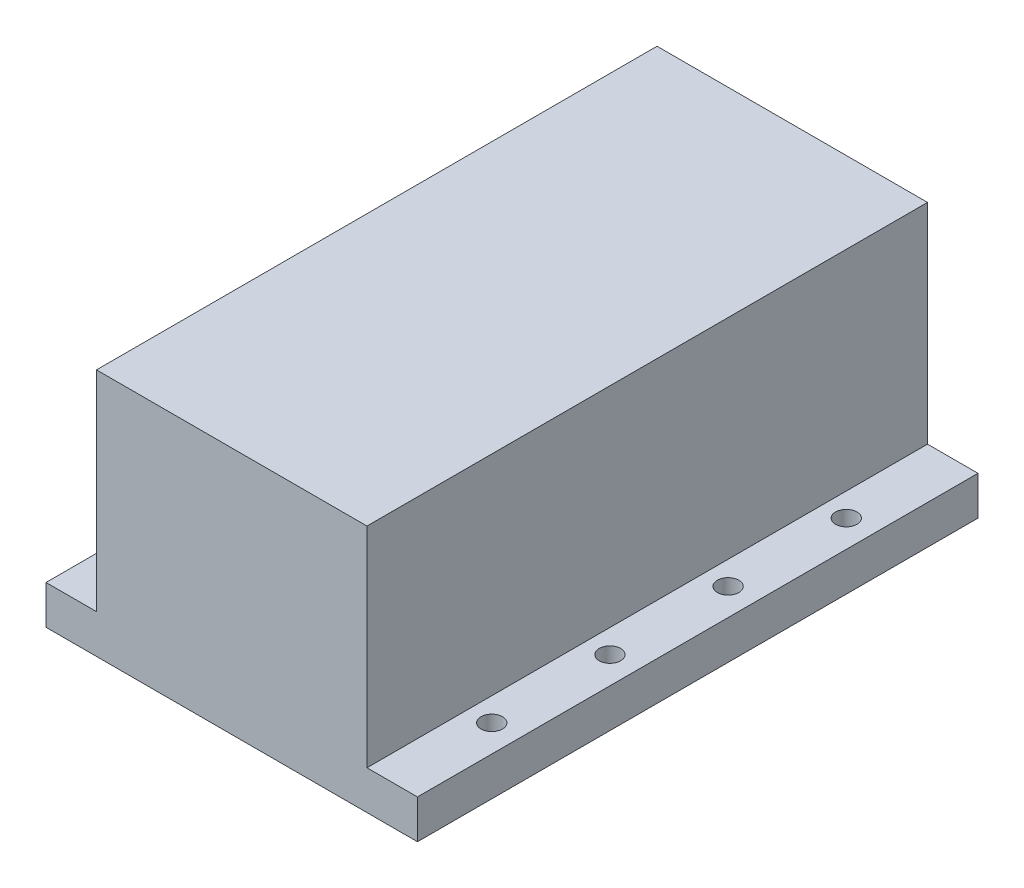
ISO-10303-21;
HEADER;
FILE_DESCRIPTION(('STEP AP214'),'2;1');
FILE_NAME('part.step','',(''),(''),'','','');
FILE_SCHEMA(('AUTOMOTIVE_DESIGN { 1 0 10303 214 1 1 1 1 }'));
ENDSEC;
DATA;
#1=APPLICATION_CONTEXT('core data for automotive mechanical design processes');
#2=APPLICATION_PROTOCOL_DEFINITION('international standard','automotive_design',2000,#1);
#3=PRODUCT_CONTEXT('',#1,'mechanical');
#4=PRODUCT('Part','Part','',(#3));
#5=PRODUCT_RELATED_PRODUCT_CATEGORY('part','',(#4));
#6=PRODUCT_DEFINITION_FORMATION('','',#4);
#7=PRODUCT_DEFINITION_CONTEXT('part definition',#1,'design');
#8=PRODUCT_DEFINITION('design','',#6,#7);
#9=PRODUCT_DEFINITION_SHAPE('','',#8);
#10=(LENGTH_UNIT() NAMED_UNIT(*) SI_UNIT(.MILLI.,.METRE.));
#11=(NAMED_UNIT(*) PLANE_ANGLE_UNIT() SI_UNIT($,.RADIAN.));
#12=(NAMED_UNIT(*) SI_UNIT($,.STERADIAN.) SOLID_ANGLE_UNIT());
#13=UNCERTAINTY_MEASURE_WITH_UNIT(LENGTH_MEASURE(1.E-05),#10,'distance_accuracy_value','');
#14=(GEOMETRIC_REPRESENTATION_CONTEXT(3) GLOBAL_UNCERTAINTY_ASSIGNED_CONTEXT((#13)) GLOBAL_UNIT_ASSIGNED_CONTEXT((#10,
#11,#12)) REPRESENTATION_CONTEXT('',''));
#15=CARTESIAN_POINT('',(0.,0.,0.));
#16=DIRECTION('',(0.,0.,1.));
#17=DIRECTION('',(1.,0.,0.));
#18=AXIS2_PLACEMENT_3D('',#15,#16,#17);
#19=CARTESIAN_POINT('',(0.,11.5,0.));
#20=DIRECTION('',(0.,-1.,0.));
#21=DIRECTION('',(0.,0.,-1.));
#22=AXIS2_PLACEMENT_3D('',#19,#20,#21);
#23=PLANE('',#22);
#24=CARTESIAN_POINT('',(8.,11.5,-30.));
#25=DIRECTION('',(0.,1.,0.));
#26=DIRECTION('',(0.,0.,1.));
#27=AXIS2_PLACEMENT_3D('',#24,#25,#26);
#28=CIRCLE('',#27,3.175);
#29=CARTESIAN_POINT('',(8.,11.5,-26.825));
#30=VERTEX_POINT('',#29);
#31=EDGE_CURVE('E129',#30,#30,#28,.T.);
#32=ORIENTED_EDGE('',*,*,#31,.F.);
#33=EDGE_LOOP('',(#32));
#34=FACE_BOUND('',#33,.T.);
#35=CARTESIAN_POINT('',(7.99999999999999,11.5,-65.));
#36=DIRECTION('',(0.,1.,0.));
#37=DIRECTION('',(0.,0.,1.));
#38=AXIS2_PLACEMENT_3D('',#35,#36,#37);
#39=CIRCLE('',#38,3.175);
#40=CARTESIAN_POINT('',(7.99999999999999,11.5,-61.825));
#41=VERTEX_POINT('',#40);
#42=EDGE_CURVE('E138',#41,#41,#39,.T.);
#43=ORIENTED_EDGE('',*,*,#42,.F.);
#44=EDGE_LOOP('',(#43));
#45=FACE_BOUND('',#44,.T.);
#46=CARTESIAN_POINT('',(7.99999999999999,11.5,-100.));
#47=DIRECTION('',(0.,1.,0.));
#48=DIRECTION('',(0.,0.,1.));
#49=AXIS2_PLACEMENT_3D('',#46,#47,#48);
#50=CIRCLE('',#49,3.175);
#51=CARTESIAN_POINT('',(7.99999999999999,11.5,-96.825));
#52=VERTEX_POINT('',#51);
#53=EDGE_CURVE('E144',#52,#52,#50,.T.);
#54=ORIENTED_EDGE('',*,*,#53,.F.);
#55=EDGE_LOOP('',(#54));
#56=FACE_BOUND('',#55,.T.);
#57=CARTESIAN_POINT('',(7.99999999999999,11.5,-135.));
#58=DIRECTION('',(0.,1.,0.));
#59=DIRECTION('',(0.,0.,1.));
#60=AXIS2_PLACEMENT_3D('',#57,#58,#59);
#61=CIRCLE('',#60,3.175);
#62=CARTESIAN_POINT('',(7.99999999999999,11.5,-131.825));
#63=VERTEX_POINT('',#62);
#64=EDGE_CURVE('E174',#63,#63,#61,.T.);
#65=ORIENTED_EDGE('',*,*,#64,.F.);
#66=EDGE_LOOP('',(#65));
#67=FACE_BOUND('',#66,.T.);
#68=DIRECTION('',(0.,0.,1.));
#69=VECTOR('',#68,1.);
#70=CARTESIAN_POINT('',(14.95,11.5,-166.));
#71=LINE('',#70,#69);
#72=CARTESIAN_POINT('',(14.95,11.5,-166.));
#73=VERTEX_POINT('',#72);
#74=CARTESIAN_POINT('',(14.95,11.5,0.));
#75=VERTEX_POINT('',#74);
#76=EDGE_CURVE('E55',#73,#75,#71,.T.);
#77=ORIENTED_EDGE('',*,*,#76,.F.);
#78=DIRECTION('',(-1.,0.,0.));
#79=VECTOR('',#78,1.);
#80=CARTESIAN_POINT('',(0.,11.5,-166.));
#81=LINE('',#80,#79);
#82=CARTESIAN_POINT('',(0.,11.5,-166.));
#83=VERTEX_POINT('',#82);
#84=EDGE_CURVE('E189',#73,#83,#81,.T.);
#85=ORIENTED_EDGE('',*,*,#84,.T.);
#86=DIRECTION('',(0.,0.,1.));
#87=VECTOR('',#86,1.);
#88=CARTESIAN_POINT('',(0.,11.5,0.));
#89=LINE('',#88,#87);
#90=CARTESIAN_POINT('',(0.,11.5,0.));
#91=VERTEX_POINT('',#90);
#92=EDGE_CURVE('E180',#83,#91,#89,.T.);
#93=ORIENTED_EDGE('',*,*,#92,.T.);
#94=DIRECTION('',(1.,0.,0.));
#95=VECTOR('',#94,1.);
#96=CARTESIAN_POINT('',(0.,11.5,0.));
#97=LINE('',#96,#95);
#98=EDGE_CURVE('E185',#91,#75,#97,.T.);
#99=ORIENTED_EDGE('',*,*,#98,.T.);
#100=EDGE_LOOP('',(#77,#85,#93,#99));
#101=FACE_BOUND('',#100,.T.);
#102=ADVANCED_FACE('F40',(#34,#45,#56,#67,#101),#23,.F.);
#103=CARTESIAN_POINT('',(102.,11.5,-30.));
#104=DIRECTION('',(0.,1.,0.));
#105=DIRECTION('',(0.,0.,1.));
#106=AXIS2_PLACEMENT_3D('',#103,#104,#105);
#107=CIRCLE('',#106,3.175);
#108=CARTESIAN_POINT('',(102.,11.5,-26.825));
#109=VERTEX_POINT('',#108);
#110=EDGE_CURVE('E150',#109,#109,#107,.T.);
#111=ORIENTED_EDGE('',*,*,#110,.F.);
#112=EDGE_LOOP('',(#111));
#113=FACE_BOUND('',#112,.T.);
#114=CARTESIAN_POINT('',(102.,11.5,-65.));
#115=DIRECTION('',(0.,1.,0.));
#116=DIRECTION('',(0.,0.,1.));
#117=AXIS2_PLACEMENT_3D('',#114,#115,#116);
#118=CIRCLE('',#117,3.175);
#119=CARTESIAN_POINT('',(102.,11.5,-61.825));
#120=VERTEX_POINT('',#119);
#121=EDGE_CURVE('E156',#120,#120,#118,.T.);
#122=ORIENTED_EDGE('',*,*,#121,.F.);
#123=EDGE_LOOP('',(#122));
#124=FACE_BOUND('',#123,.T.);
#125=CARTESIAN_POINT('',(102.,11.5,-100.));
#126=DIRECTION('',(0.,1.,0.));
#127=DIRECTION('',(0.,0.,1.));
#128=AXIS2_PLACEMENT_3D('',#125,#126,#127);
#129=CIRCLE('',#128,3.175);
#130=CARTESIAN_POINT('',(102.,11.5,-96.825));
#131=VERTEX_POINT('',#130);
#132=EDGE_CURVE('E162',#131,#131,#129,.T.);
#133=ORIENTED_EDGE('',*,*,#132,.F.);
#134=EDGE_LOOP('',(#133));
#135=FACE_BOUND('',#134,.T.);
#136=CARTESIAN_POINT('',(102.,11.5,-135.));
#137=DIRECTION('',(0.,1.,0.));
#138=DIRECTION('',(0.,0.,1.));
#139=AXIS2_PLACEMENT_3D('',#136,#137,#138);
#140=CIRCLE('',#139,3.175);
#141=CARTESIAN_POINT('',(102.,11.5,-131.825));
#142=VERTEX_POINT('',#141);
#143=EDGE_CURVE('E168',#142,#142,#140,.T.);
#144=ORIENTED_EDGE('',*,*,#143,.F.);
#145=EDGE_LOOP('',(#144));
#146=FACE_BOUND('',#145,.T.);
#147=DIRECTION('',(0.,0.,-1.));
#148=VECTOR('',#147,1.);
#149=CARTESIAN_POINT('',(95.05,11.5,-166.));
#150=LINE('',#149,#148);
#151=CARTESIAN_POINT('',(95.05,11.5,0.));
#152=VERTEX_POINT('',#151);
#153=CARTESIAN_POINT('',(95.05,11.5,-166.));
#154=VERTEX_POINT('',#153);
#155=EDGE_CURVE('E63',#152,#154,#150,.T.);
#156=ORIENTED_EDGE('',*,*,#155,.F.);
#157=CARTESIAN_POINT('',(110.,11.5,0.));
#158=VERTEX_POINT('',#157);
#159=EDGE_CURVE('E183',#152,#158,#97,.T.);
#160=ORIENTED_EDGE('',*,*,#159,.T.);
#161=DIRECTION('',(0.,0.,-1.));
#162=VECTOR('',#161,1.);
#163=CARTESIAN_POINT('',(110.,11.5,0.));
#164=LINE('',#163,#162);
#165=CARTESIAN_POINT('',(110.,11.5,-166.));
#166=VERTEX_POINT('',#165);
#167=EDGE_CURVE('E187',#158,#166,#164,.T.);
#168=ORIENTED_EDGE('',*,*,#167,.T.);
#169=EDGE_CURVE('E190',#166,#154,#81,.T.);
#170=ORIENTED_EDGE('',*,*,#169,.T.);
#171=EDGE_LOOP('',(#156,#160,#168,#170));
#172=FACE_BOUND('',#171,.T.);
#173=ADVANCED_FACE('F233',(#113,#124,#135,#146,#172),#23,.F.);
#174=CARTESIAN_POINT('',(0.,0.,0.));
#175=DIRECTION('',(0.,-1.,0.));
#176=DIRECTION('',(0.,0.,-1.));
#177=AXIS2_PLACEMENT_3D('',#174,#175,#176);
#178=PLANE('',#177);
#179=CARTESIAN_POINT('',(7.99999999999999,0.,-65.));
#180=DIRECTION('',(0.,1.,0.));
#181=DIRECTION('',(0.,0.,1.));
#182=AXIS2_PLACEMENT_3D('',#179,#180,#181);
#183=CIRCLE('',#182,3.175);
#184=CARTESIAN_POINT('',(7.99999999999999,0.,-61.825));
#185=VERTEX_POINT('',#184);
#186=EDGE_CURVE('E136',#185,#185,#183,.T.);
#187=ORIENTED_EDGE('',*,*,#186,.T.);
#188=EDGE_LOOP('',(#187));
#189=FACE_BOUND('',#188,.T.);
#190=CARTESIAN_POINT('',(102.,0.,-30.));
#191=DIRECTION('',(0.,1.,0.));
#192=DIRECTION('',(0.,0.,1.));
#193=AXIS2_PLACEMENT_3D('',#190,#191,#192);
#194=CIRCLE('',#193,3.175);
#195=CARTESIAN_POINT('',(102.,0.,-26.825));
#196=VERTEX_POINT('',#195);
#197=EDGE_CURVE('E147',#196,#196,#194,.T.);
#198=ORIENTED_EDGE('',*,*,#197,.T.);
#199=EDGE_LOOP('',(#198));
#200=FACE_BOUND('',#199,.T.);
#201=CARTESIAN_POINT('',(102.,0.,-100.));
#202=DIRECTION('',(0.,1.,0.));
#203=DIRECTION('',(0.,0.,1.));
#204=AXIS2_PLACEMENT_3D('',#201,#202,#203);
#205=CIRCLE('',#204,3.175);
#206=CARTESIAN_POINT('',(102.,0.,-96.825));
#207=VERTEX_POINT('',#206);
#208=EDGE_CURVE('E159',#207,#207,#205,.T.);
#209=ORIENTED_EDGE('',*,*,#208,.T.);
#210=EDGE_LOOP('',(#209));
#211=FACE_BOUND('',#210,.T.);
#212=CARTESIAN_POINT('',(7.99999999999999,0.,-135.));
#213=DIRECTION('',(0.,1.,0.));
#214=DIRECTION('',(0.,0.,1.));
#215=AXIS2_PLACEMENT_3D('',#212,#213,#214);
#216=CIRCLE('',#215,3.175);
#217=CARTESIAN_POINT('',(7.99999999999999,0.,-131.825));
#218=VERTEX_POINT('',#217);
#219=EDGE_CURVE('E171',#218,#218,#216,.T.);
#220=ORIENTED_EDGE('',*,*,#219,.T.);
#221=EDGE_LOOP('',(#220));
#222=FACE_BOUND('',#221,.T.);
#223=DIRECTION('',(0.,0.,1.));
#224=VECTOR('',#223,1.);
#225=CARTESIAN_POINT('',(0.,0.,0.));
#226=LINE('',#225,#224);
#227=CARTESIAN_POINT('',(0.,0.,-166.));
#228=VERTEX_POINT('',#227);
#229=CARTESIAN_POINT('',(0.,0.,0.));
#230=VERTEX_POINT('',#229);
#231=EDGE_CURVE('E177',#228,#230,#226,.T.);
#232=ORIENTED_EDGE('',*,*,#231,.F.);
#233=DIRECTION('',(-1.,0.,0.));
#234=VECTOR('',#233,1.);
#235=CARTESIAN_POINT('',(0.,0.,-166.));
#236=LINE('',#235,#234);
#237=CARTESIAN_POINT('',(110.,0.,-166.));
#238=VERTEX_POINT('',#237);
#239=EDGE_CURVE('E184',#238,#228,#236,.T.);
#240=ORIENTED_EDGE('',*,*,#239,.F.);
#241=DIRECTION('',(0.,0.,-1.));
#242=VECTOR('',#241,1.);
#243=CARTESIAN_POINT('',(110.,0.,0.));
#244=LINE('',#243,#242);
#245=CARTESIAN_POINT('',(110.,0.,0.));
#246=VERTEX_POINT('',#245);
#247=EDGE_CURVE('E197',#246,#238,#244,.T.);
#248=ORIENTED_EDGE('',*,*,#247,.F.);
#249=DIRECTION('',(1.,0.,0.));
#250=VECTOR('',#249,1.);
#251=CARTESIAN_POINT('',(0.,0.,0.));
#252=LINE('',#251,#250);
#253=EDGE_CURVE('E195',#230,#246,#252,.T.);
#254=ORIENTED_EDGE('',*,*,#253,.F.);
#255=EDGE_LOOP('',(#232,#240,#248,#254));
#256=FACE_BOUND('',#255,.T.);
#257=CARTESIAN_POINT('',(102.,0.,-135.));
#258=DIRECTION('',(0.,1.,0.));
#259=DIRECTION('',(0.,0.,1.));
#260=AXIS2_PLACEMENT_3D('',#257,#258,#259);
#261=CIRCLE('',#260,3.175);
#262=CARTESIAN_POINT('',(102.,0.,-131.825));
#263=VERTEX_POINT('',#262);
#264=EDGE_CURVE('E165',#263,#263,#261,.T.);
#265=ORIENTED_EDGE('',*,*,#264,.T.);
#266=EDGE_LOOP('',(#265));
#267=FACE_BOUND('',#266,.T.);
#268=CARTESIAN_POINT('',(102.,0.,-65.));
#269=DIRECTION('',(0.,1.,0.));
#270=DIRECTION('',(0.,0.,1.));
#271=AXIS2_PLACEMENT_3D('',#268,#269,#270);
#272=CIRCLE('',#271,3.175);
#273=CARTESIAN_POINT('',(102.,0.,-61.825));
#274=VERTEX_POINT('',#273);
#275=EDGE_CURVE('E153',#274,#274,#272,.T.);
#276=ORIENTED_EDGE('',*,*,#275,.T.);
#277=EDGE_LOOP('',(#276));
#278=FACE_BOUND('',#277,.T.);
#279=CARTESIAN_POINT('',(7.99999999999999,0.,-100.));
#280=DIRECTION('',(0.,1.,0.));
#281=DIRECTION('',(0.,0.,1.));
#282=AXIS2_PLACEMENT_3D('',#279,#280,#281);
#283=CIRCLE('',#282,3.175);
#284=CARTESIAN_POINT('',(7.99999999999999,0.,-96.825));
#285=VERTEX_POINT('',#284);
#286=EDGE_CURVE('E141',#285,#285,#283,.T.);
#287=ORIENTED_EDGE('',*,*,#286,.T.);
#288=EDGE_LOOP('',(#287));
#289=FACE_BOUND('',#288,.T.);
#290=CARTESIAN_POINT('',(8.,0.,-30.));
#291=DIRECTION('',(0.,1.,0.));
#292=DIRECTION('',(0.,0.,1.));
#293=AXIS2_PLACEMENT_3D('',#290,#291,#292);
#294=CIRCLE('',#293,3.175);
#295=CARTESIAN_POINT('',(8.,0.,-26.825));
#296=VERTEX_POINT('',#295);
#297=EDGE_CURVE('E126',#296,#296,#294,.T.);
#298=ORIENTED_EDGE('',*,*,#297,.T.);
#299=EDGE_LOOP('',(#298));
#300=FACE_BOUND('',#299,.T.);
#301=ADVANCED_FACE('F214',(#189,#200,#211,#222,#256,#267,#278,#289,#300),#178,.T.);
#302=CARTESIAN_POINT('',(0.,11.5,0.));
#303=DIRECTION('',(1.,0.,0.));
#304=DIRECTION('',(0.,0.,-1.));
#305=AXIS2_PLACEMENT_3D('',#302,#303,#304);
#306=PLANE('',#305);
#307=ORIENTED_EDGE('',*,*,#231,.T.);
#308=DIRECTION('',(0.,-1.,0.));
#309=VECTOR('',#308,1.);
#310=CARTESIAN_POINT('',(0.,11.5,0.));
#311=LINE('',#310,#309);
#312=EDGE_CURVE('E11',#91,#230,#311,.T.);
#313=ORIENTED_EDGE('',*,*,#312,.F.);
#314=ORIENTED_EDGE('',*,*,#92,.F.);
#315=DIRECTION('',(0.,-1.,0.));
#316=VECTOR('',#315,1.);
#317=CARTESIAN_POINT('',(0.,11.5,-166.));
#318=LINE('',#317,#316);
#319=EDGE_CURVE('E192',#83,#228,#318,.T.);
#320=ORIENTED_EDGE('',*,*,#319,.T.);
#321=EDGE_LOOP('',(#307,#313,#314,#320));
#322=FACE_BOUND('',#321,.T.);
#323=ADVANCED_FACE('F42',(#322),#306,.F.);
#324=CARTESIAN_POINT('',(0.,11.5,0.));
#325=DIRECTION('',(0.,0.,-1.));
#326=DIRECTION('',(-1.,0.,0.));
#327=AXIS2_PLACEMENT_3D('',#324,#325,#326);
#328=PLANE('',#327);
#329=ORIENTED_EDGE('',*,*,#253,.T.);
#330=DIRECTION('',(0.,-1.,0.));
#331=VECTOR('',#330,1.);
#332=CARTESIAN_POINT('',(110.,11.5,0.));
#333=LINE('',#332,#331);
#334=EDGE_CURVE('E48',#158,#246,#333,.T.);
#335=ORIENTED_EDGE('',*,*,#334,.F.);
#336=ORIENTED_EDGE('',*,*,#159,.F.);
#337=DIRECTION('',(0.,-1.,0.));
#338=VECTOR('',#337,1.);
#339=CARTESIAN_POINT('',(95.05,73.5,0.));
#340=LINE('',#339,#338);
#341=CARTESIAN_POINT('',(95.05,73.5,0.));
#342=VERTEX_POINT('',#341);
#343=EDGE_CURVE('E111',#342,#152,#340,.T.);
#344=ORIENTED_EDGE('',*,*,#343,.F.);
#345=DIRECTION('',(1.,0.,0.));
#346=VECTOR('',#345,1.);
#347=CARTESIAN_POINT('',(14.95,73.5,0.));
#348=LINE('',#347,#346);
#349=CARTESIAN_POINT('',(14.95,73.5,0.));
#350=VERTEX_POINT('',#349);
#351=EDGE_CURVE('E105',#350,#342,#348,.T.);
#352=ORIENTED_EDGE('',*,*,#351,.F.);
#353=DIRECTION('',(0.,-1.,0.));
#354=VECTOR('',#353,1.);
#355=CARTESIAN_POINT('',(14.95,73.5,0.));
#356=LINE('',#355,#354);
#357=EDGE_CURVE('E109',#350,#75,#356,.T.);
#358=ORIENTED_EDGE('',*,*,#357,.T.);
#359=ORIENTED_EDGE('',*,*,#98,.F.);
#360=ORIENTED_EDGE('',*,*,#312,.T.);
#361=EDGE_LOOP('',(#329,#335,#336,#344,#352,#358,#359,#360));
#362=FACE_BOUND('',#361,.T.);
#363=ADVANCED_FACE('F107',(#362),#328,.F.);
#364=CARTESIAN_POINT('',(110.,11.5,0.));
#365=DIRECTION('',(-1.,0.,0.));
#366=DIRECTION('',(0.,0.,1.));
#367=AXIS2_PLACEMENT_3D('',#364,#365,#366);
#368=PLANE('',#367);
#369=ORIENTED_EDGE('',*,*,#247,.T.);
#370=DIRECTION('',(0.,-1.,0.));
#371=VECTOR('',#370,1.);
#372=CARTESIAN_POINT('',(110.,11.5,-166.));
#373=LINE('',#372,#371);
#374=EDGE_CURVE('E202',#166,#238,#373,.T.);
#375=ORIENTED_EDGE('',*,*,#374,.F.);
#376=ORIENTED_EDGE('',*,*,#167,.F.);
#377=ORIENTED_EDGE('',*,*,#334,.T.);
#378=EDGE_LOOP('',(#369,#375,#376,#377));
#379=FACE_BOUND('',#378,.T.);
#380=ADVANCED_FACE('F209',(#379),#368,.F.);
#381=CARTESIAN_POINT('',(0.,11.5,-166.));
#382=DIRECTION('',(0.,0.,1.));
#383=DIRECTION('',(1.,0.,0.));
#384=AXIS2_PLACEMENT_3D('',#381,#382,#383);
#385=PLANE('',#384);
#386=ORIENTED_EDGE('',*,*,#239,.T.);
#387=ORIENTED_EDGE('',*,*,#319,.F.);
#388=ORIENTED_EDGE('',*,*,#84,.F.);
#389=DIRECTION('',(0.,-1.,0.));
#390=VECTOR('',#389,1.);
#391=CARTESIAN_POINT('',(14.95,73.5,-166.));
#392=LINE('',#391,#390);
#393=CARTESIAN_POINT('',(14.95,73.5,-166.));
#394=VERTEX_POINT('',#393);
#395=EDGE_CURVE('E223',#394,#73,#392,.T.);
#396=ORIENTED_EDGE('',*,*,#395,.F.);
#397=DIRECTION('',(-1.,0.,0.));
#398=VECTOR('',#397,1.);
#399=CARTESIAN_POINT('',(14.95,73.5,-166.));
#400=LINE('',#399,#398);
#401=CARTESIAN_POINT('',(95.05,73.5,-166.));
#402=VERTEX_POINT('',#401);
#403=EDGE_CURVE('E120',#402,#394,#400,.T.);
#404=ORIENTED_EDGE('',*,*,#403,.F.);
#405=DIRECTION('',(0.,-1.,0.));
#406=VECTOR('',#405,1.);
#407=CARTESIAN_POINT('',(95.05,73.5,-166.));
#408=LINE('',#407,#406);
#409=EDGE_CURVE('E131',#402,#154,#408,.T.);
#410=ORIENTED_EDGE('',*,*,#409,.T.);
#411=ORIENTED_EDGE('',*,*,#169,.F.);
#412=ORIENTED_EDGE('',*,*,#374,.T.);
#413=EDGE_LOOP('',(#386,#387,#388,#396,#404,#410,#411,#412));
#414=FACE_BOUND('',#413,.T.);
#415=ADVANCED_FACE('F218',(#414),#385,.F.);
#416=CARTESIAN_POINT('',(7.99999999999999,11.5,-135.));
#417=DIRECTION('',(0.,-1.,0.));
#418=DIRECTION('',(0.,0.,-1.));
#419=AXIS2_PLACEMENT_3D('',#416,#417,#418);
#420=CYLINDRICAL_SURFACE('',#419,3.175);
#421=ORIENTED_EDGE('',*,*,#64,.T.);
#422=EDGE_LOOP('',(#421));
#423=FACE_BOUND('',#422,.T.);
#424=ORIENTED_EDGE('',*,*,#219,.F.);
#425=EDGE_LOOP('',(#424));
#426=FACE_BOUND('',#425,.T.);
#427=ADVANCED_FACE('F247',(#423,#426),#420,.F.);
#428=CARTESIAN_POINT('',(102.,11.5,-135.));
#429=DIRECTION('',(0.,-1.,0.));
#430=DIRECTION('',(0.,0.,-1.));
#431=AXIS2_PLACEMENT_3D('',#428,#429,#430);
#432=CYLINDRICAL_SURFACE('',#431,3.175);
#433=ORIENTED_EDGE('',*,*,#143,.T.);
#434=EDGE_LOOP('',(#433));
#435=FACE_BOUND('',#434,.T.);
#436=ORIENTED_EDGE('',*,*,#264,.F.);
#437=EDGE_LOOP('',(#436));
#438=FACE_BOUND('',#437,.T.);
#439=ADVANCED_FACE('F306',(#435,#438),#432,.F.);
#440=CARTESIAN_POINT('',(102.,11.5,-100.));
#441=DIRECTION('',(0.,-1.,0.));
#442=DIRECTION('',(0.,0.,-1.));
#443=AXIS2_PLACEMENT_3D('',#440,#441,#442);
#444=CYLINDRICAL_SURFACE('',#443,3.175);
#445=ORIENTED_EDGE('',*,*,#132,.T.);
#446=EDGE_LOOP('',(#445));
#447=FACE_BOUND('',#446,.T.);
#448=ORIENTED_EDGE('',*,*,#208,.F.);
#449=EDGE_LOOP('',(#448));
#450=FACE_BOUND('',#449,.T.);
#451=ADVANCED_FACE('F316',(#447,#450),#444,.F.);
#452=CARTESIAN_POINT('',(102.,11.5,-65.));
#453=DIRECTION('',(0.,-1.,0.));
#454=DIRECTION('',(0.,0.,-1.));
#455=AXIS2_PLACEMENT_3D('',#452,#453,#454);
#456=CYLINDRICAL_SURFACE('',#455,3.175);
#457=ORIENTED_EDGE('',*,*,#121,.T.);
#458=EDGE_LOOP('',(#457));
#459=FACE_BOUND('',#458,.T.);
#460=ORIENTED_EDGE('',*,*,#275,.F.);
#461=EDGE_LOOP('',(#460));
#462=FACE_BOUND('',#461,.T.);
#463=ADVANCED_FACE('F326',(#459,#462),#456,.F.);
#464=CARTESIAN_POINT('',(102.,11.5,-30.));
#465=DIRECTION('',(0.,-1.,0.));
#466=DIRECTION('',(0.,0.,-1.));
#467=AXIS2_PLACEMENT_3D('',#464,#465,#466);
#468=CYLINDRICAL_SURFACE('',#467,3.175);
#469=ORIENTED_EDGE('',*,*,#110,.T.);
#470=EDGE_LOOP('',(#469));
#471=FACE_BOUND('',#470,.T.);
#472=ORIENTED_EDGE('',*,*,#197,.F.);
#473=EDGE_LOOP('',(#472));
#474=FACE_BOUND('',#473,.T.);
#475=ADVANCED_FACE('F337',(#471,#474),#468,.F.);
#476=CARTESIAN_POINT('',(7.99999999999999,11.5,-100.));
#477=DIRECTION('',(0.,-1.,0.));
#478=DIRECTION('',(0.,0.,-1.));
#479=AXIS2_PLACEMENT_3D('',#476,#477,#478);
#480=CYLINDRICAL_SURFACE('',#479,3.175);
#481=ORIENTED_EDGE('',*,*,#53,.T.);
#482=EDGE_LOOP('',(#481));
#483=FACE_BOUND('',#482,.T.);
#484=ORIENTED_EDGE('',*,*,#286,.F.);
#485=EDGE_LOOP('',(#484));
#486=FACE_BOUND('',#485,.T.);
#487=ADVANCED_FACE('F348',(#483,#486),#480,.F.);
#488=CARTESIAN_POINT('',(7.99999999999999,11.5,-65.));
#489=DIRECTION('',(0.,-1.,0.));
#490=DIRECTION('',(0.,0.,-1.));
#491=AXIS2_PLACEMENT_3D('',#488,#489,#490);
#492=CYLINDRICAL_SURFACE('',#491,3.175);
#493=ORIENTED_EDGE('',*,*,#42,.T.);
#494=EDGE_LOOP('',(#493));
#495=FACE_BOUND('',#494,.T.);
#496=ORIENTED_EDGE('',*,*,#186,.F.);
#497=EDGE_LOOP('',(#496));
#498=FACE_BOUND('',#497,.T.);
#499=ADVANCED_FACE('F359',(#495,#498),#492,.F.);
#500=CARTESIAN_POINT('',(8.,11.5,-30.));
#501=DIRECTION('',(0.,-1.,0.));
#502=DIRECTION('',(0.,0.,-1.));
#503=AXIS2_PLACEMENT_3D('',#500,#501,#502);
#504=CYLINDRICAL_SURFACE('',#503,3.175);
#505=ORIENTED_EDGE('',*,*,#31,.T.);
#506=EDGE_LOOP('',(#505));
#507=FACE_BOUND('',#506,.T.);
#508=ORIENTED_EDGE('',*,*,#297,.F.);
#509=EDGE_LOOP('',(#508));
#510=FACE_BOUND('',#509,.T.);
#511=ADVANCED_FACE('F370',(#507,#510),#504,.F.);
#512=CARTESIAN_POINT('',(14.95,73.5,-166.));
#513=DIRECTION('',(1.,0.,0.));
#514=DIRECTION('',(0.,0.,-1.));
#515=AXIS2_PLACEMENT_3D('',#512,#513,#514);
#516=PLANE('',#515);
#517=ORIENTED_EDGE('',*,*,#76,.T.);
#518=ORIENTED_EDGE('',*,*,#357,.F.);
#519=DIRECTION('',(0.,0.,1.));
#520=VECTOR('',#519,1.);
#521=CARTESIAN_POINT('',(14.95,73.5,-166.));
#522=LINE('',#521,#520);
#523=EDGE_CURVE('E115',#394,#350,#522,.T.);
#524=ORIENTED_EDGE('',*,*,#523,.F.);
#525=ORIENTED_EDGE('',*,*,#395,.T.);
#526=EDGE_LOOP('',(#517,#518,#524,#525));
#527=FACE_BOUND('',#526,.T.);
#528=ADVANCED_FACE('F125',(#527),#516,.F.);
#529=CARTESIAN_POINT('',(95.05,73.5,-166.));
#530=DIRECTION('',(-1.,0.,0.));
#531=DIRECTION('',(0.,0.,1.));
#532=AXIS2_PLACEMENT_3D('',#529,#530,#531);
#533=PLANE('',#532);
#534=ORIENTED_EDGE('',*,*,#155,.T.);
#535=ORIENTED_EDGE('',*,*,#409,.F.);
#536=DIRECTION('',(0.,0.,-1.));
#537=VECTOR('',#536,1.);
#538=CARTESIAN_POINT('',(95.05,73.5,-166.));
#539=LINE('',#538,#537);
#540=EDGE_CURVE('E114',#342,#402,#539,.T.);
#541=ORIENTED_EDGE('',*,*,#540,.F.);
#542=ORIENTED_EDGE('',*,*,#343,.T.);
#543=EDGE_LOOP('',(#534,#535,#541,#542));
#544=FACE_BOUND('',#543,.T.);
#545=ADVANCED_FACE('F232',(#544),#533,.F.);
#546=CARTESIAN_POINT('',(0.,73.5,0.));
#547=DIRECTION('',(0.,1.,0.));
#548=DIRECTION('',(0.,0.,1.));
#549=AXIS2_PLACEMENT_3D('',#546,#547,#548);
#550=PLANE('',#549);
#551=ORIENTED_EDGE('',*,*,#523,.T.);
#552=ORIENTED_EDGE('',*,*,#351,.T.);
#553=ORIENTED_EDGE('',*,*,#540,.T.);
#554=ORIENTED_EDGE('',*,*,#403,.T.);
#555=EDGE_LOOP('',(#551,#552,#553,#554));
#556=FACE_BOUND('',#555,.T.);
#557=ADVANCED_FACE('F118',(#556),#550,.T.);
#558=CLOSED_SHELL('',(#102,#173,#301,#323,#363,#380,#415,#427,#439,#451,#463,#475,#487,#499,
#511,#528,#545,#557));
#559=MANIFOLD_SOLID_BREP('B2',#558);
#560=ADVANCED_BREP_SHAPE_REPRESENTATION('',(#18,#559),#14);
#561=SHAPE_DEFINITION_REPRESENTATION(#9,#560);
ENDSEC;
END-ISO-10303-21;
